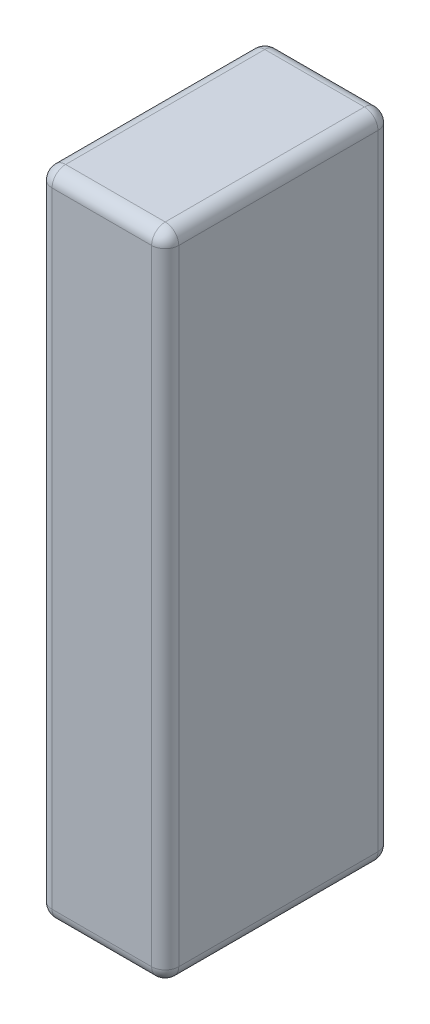
ISO-10303-21;
HEADER;
FILE_DESCRIPTION(('STEP AP214'),'2;1');
FILE_NAME('part.step','',(''),(''),'','','');
FILE_SCHEMA(('AUTOMOTIVE_DESIGN { 1 0 10303 214 1 1 1 1 }'));
ENDSEC;
DATA;
#1=APPLICATION_CONTEXT('core data for automotive mechanical design processes');
#2=APPLICATION_PROTOCOL_DEFINITION('international standard','automotive_design',2000,#1);
#3=PRODUCT_CONTEXT('',#1,'mechanical');
#4=PRODUCT('Part','Part','',(#3));
#5=PRODUCT_RELATED_PRODUCT_CATEGORY('part','',(#4));
#6=PRODUCT_DEFINITION_FORMATION('','',#4);
#7=PRODUCT_DEFINITION_CONTEXT('part definition',#1,'design');
#8=PRODUCT_DEFINITION('design','',#6,#7);
#9=PRODUCT_DEFINITION_SHAPE('','',#8);
#10=(LENGTH_UNIT() NAMED_UNIT(*) SI_UNIT(.MILLI.,.METRE.));
#11=(NAMED_UNIT(*) PLANE_ANGLE_UNIT() SI_UNIT($,.RADIAN.));
#12=(NAMED_UNIT(*) SI_UNIT($,.STERADIAN.) SOLID_ANGLE_UNIT());
#13=UNCERTAINTY_MEASURE_WITH_UNIT(LENGTH_MEASURE(1.E-05),#10,'distance_accuracy_value','');
#14=(GEOMETRIC_REPRESENTATION_CONTEXT(3) GLOBAL_UNCERTAINTY_ASSIGNED_CONTEXT((#13)) GLOBAL_UNIT_ASSIGNED_CONTEXT((#10,
#11,#12)) REPRESENTATION_CONTEXT('',''));
#15=CARTESIAN_POINT('',(0.,0.,0.));
#16=DIRECTION('',(0.,0.,1.));
#17=DIRECTION('',(1.,0.,0.));
#18=AXIS2_PLACEMENT_3D('',#15,#16,#17);
#19=CARTESIAN_POINT('',(0.,144.,0.));
#20=DIRECTION('',(1.,0.,0.));
#21=DIRECTION('',(0.,0.,-1.));
#22=AXIS2_PLACEMENT_3D('',#19,#20,#21);
#23=PLANE('',#22);
#24=DIRECTION('',(0.,0.,1.));
#25=VECTOR('',#24,1.);
#26=CARTESIAN_POINT('',(0.,141.,0.));
#27=LINE('',#26,#25);
#28=CARTESIAN_POINT('',(0.,141.,-3.));
#29=VERTEX_POINT('',#28);
#30=CARTESIAN_POINT('',(0.,141.,-47.));
#31=VERTEX_POINT('',#30);
#32=EDGE_CURVE('E152',#29,#31,#27,.F.);
#33=ORIENTED_EDGE('',*,*,#32,.T.);
#34=DIRECTION('',(0.,-1.,0.));
#35=VECTOR('',#34,1.);
#36=CARTESIAN_POINT('',(0.,144.,-47.));
#37=LINE('',#36,#35);
#38=CARTESIAN_POINT('',(0.,3.,-47.));
#39=VERTEX_POINT('',#38);
#40=EDGE_CURVE('E220',#31,#39,#37,.T.);
#41=ORIENTED_EDGE('',*,*,#40,.T.);
#42=DIRECTION('',(0.,0.,1.));
#43=VECTOR('',#42,1.);
#44=CARTESIAN_POINT('',(0.,3.,0.));
#45=LINE('',#44,#43);
#46=CARTESIAN_POINT('',(0.,3.,-3.));
#47=VERTEX_POINT('',#46);
#48=EDGE_CURVE('E279',#39,#47,#45,.T.);
#49=ORIENTED_EDGE('',*,*,#48,.T.);
#50=DIRECTION('',(0.,-1.,0.));
#51=VECTOR('',#50,1.);
#52=CARTESIAN_POINT('',(0.,144.,-3.));
#53=LINE('',#52,#51);
#54=EDGE_CURVE('E277',#47,#29,#53,.F.);
#55=ORIENTED_EDGE('',*,*,#54,.T.);
#56=EDGE_LOOP('',(#33,#41,#49,#55));
#57=FACE_BOUND('',#56,.T.);
#58=ADVANCED_FACE('F33',(#57),#23,.F.);
#59=CARTESIAN_POINT('',(0.,144.,0.));
#60=DIRECTION('',(0.,0.,-1.));
#61=DIRECTION('',(-1.,0.,0.));
#62=AXIS2_PLACEMENT_3D('',#59,#60,#61);
#63=PLANE('',#62);
#64=DIRECTION('',(1.,0.,0.));
#65=VECTOR('',#64,1.);
#66=CARTESIAN_POINT('',(0.,141.,0.));
#67=LINE('',#66,#65);
#68=CARTESIAN_POINT('',(25.,141.,0.));
#69=VERTEX_POINT('',#68);
#70=CARTESIAN_POINT('',(3.,141.,0.));
#71=VERTEX_POINT('',#70);
#72=EDGE_CURVE('E42',#69,#71,#67,.F.);
#73=ORIENTED_EDGE('',*,*,#72,.T.);
#74=DIRECTION('',(0.,-1.,0.));
#75=VECTOR('',#74,1.);
#76=CARTESIAN_POINT('',(3.,144.,0.));
#77=LINE('',#76,#75);
#78=CARTESIAN_POINT('',(3.,3.,0.));
#79=VERTEX_POINT('',#78);
#80=EDGE_CURVE('E11',#71,#79,#77,.T.);
#81=ORIENTED_EDGE('',*,*,#80,.T.);
#82=DIRECTION('',(1.,0.,0.));
#83=VECTOR('',#82,1.);
#84=CARTESIAN_POINT('',(28.,3.,0.));
#85=LINE('',#84,#83);
#86=CARTESIAN_POINT('',(25.,3.,0.));
#87=VERTEX_POINT('',#86);
#88=EDGE_CURVE('E226',#79,#87,#85,.T.);
#89=ORIENTED_EDGE('',*,*,#88,.T.);
#90=DIRECTION('',(0.,-1.,0.));
#91=VECTOR('',#90,1.);
#92=CARTESIAN_POINT('',(25.,144.,0.));
#93=LINE('',#92,#91);
#94=EDGE_CURVE('E53',#87,#69,#93,.F.);
#95=ORIENTED_EDGE('',*,*,#94,.T.);
#96=EDGE_LOOP('',(#73,#81,#89,#95));
#97=FACE_BOUND('',#96,.T.);
#98=ADVANCED_FACE('F317',(#97),#63,.F.);
#99=CARTESIAN_POINT('',(28.,144.,0.));
#100=DIRECTION('',(-1.,0.,0.));
#101=DIRECTION('',(0.,0.,1.));
#102=AXIS2_PLACEMENT_3D('',#99,#100,#101);
#103=PLANE('',#102);
#104=DIRECTION('',(0.,-1.,0.));
#105=VECTOR('',#104,1.);
#106=CARTESIAN_POINT('',(28.,144.,-47.));
#107=LINE('',#106,#105);
#108=CARTESIAN_POINT('',(28.,3.,-47.));
#109=VERTEX_POINT('',#108);
#110=CARTESIAN_POINT('',(28.,141.,-47.));
#111=VERTEX_POINT('',#110);
#112=EDGE_CURVE('E215',#109,#111,#107,.F.);
#113=ORIENTED_EDGE('',*,*,#112,.T.);
#114=DIRECTION('',(0.,0.,-1.));
#115=VECTOR('',#114,1.);
#116=CARTESIAN_POINT('',(28.,141.,0.));
#117=LINE('',#116,#115);
#118=CARTESIAN_POINT('',(28.,141.,-3.));
#119=VERTEX_POINT('',#118);
#120=EDGE_CURVE('E218',#111,#119,#117,.F.);
#121=ORIENTED_EDGE('',*,*,#120,.T.);
#122=DIRECTION('',(0.,-1.,0.));
#123=VECTOR('',#122,1.);
#124=CARTESIAN_POINT('',(28.,144.,-3.));
#125=LINE('',#124,#123);
#126=CARTESIAN_POINT('',(28.,3.,-3.));
#127=VERTEX_POINT('',#126);
#128=EDGE_CURVE('E216',#119,#127,#125,.T.);
#129=ORIENTED_EDGE('',*,*,#128,.T.);
#130=DIRECTION('',(0.,0.,-1.));
#131=VECTOR('',#130,1.);
#132=CARTESIAN_POINT('',(28.,3.,-50.));
#133=LINE('',#132,#131);
#134=EDGE_CURVE('E212',#127,#109,#133,.T.);
#135=ORIENTED_EDGE('',*,*,#134,.T.);
#136=EDGE_LOOP('',(#113,#121,#129,#135));
#137=FACE_BOUND('',#136,.T.);
#138=ADVANCED_FACE('F297',(#137),#103,.F.);
#139=CARTESIAN_POINT('',(0.,144.,-50.));
#140=DIRECTION('',(0.,0.,1.));
#141=DIRECTION('',(1.,0.,0.));
#142=AXIS2_PLACEMENT_3D('',#139,#140,#141);
#143=PLANE('',#142);
#144=DIRECTION('',(-1.,0.,0.));
#145=VECTOR('',#144,1.);
#146=CARTESIAN_POINT('',(0.,3.,-50.));
#147=LINE('',#146,#145);
#148=CARTESIAN_POINT('',(25.,3.,-50.));
#149=VERTEX_POINT('',#148);
#150=CARTESIAN_POINT('',(3.,3.,-50.));
#151=VERTEX_POINT('',#150);
#152=EDGE_CURVE('E256',#149,#151,#147,.T.);
#153=ORIENTED_EDGE('',*,*,#152,.T.);
#154=DIRECTION('',(0.,-1.,0.));
#155=VECTOR('',#154,1.);
#156=CARTESIAN_POINT('',(3.,144.,-50.));
#157=LINE('',#156,#155);
#158=CARTESIAN_POINT('',(3.,141.,-50.));
#159=VERTEX_POINT('',#158);
#160=EDGE_CURVE('E262',#151,#159,#157,.F.);
#161=ORIENTED_EDGE('',*,*,#160,.T.);
#162=DIRECTION('',(-1.,0.,0.));
#163=VECTOR('',#162,1.);
#164=CARTESIAN_POINT('',(0.,141.,-50.));
#165=LINE('',#164,#163);
#166=CARTESIAN_POINT('',(25.,141.,-50.));
#167=VERTEX_POINT('',#166);
#168=EDGE_CURVE('E259',#159,#167,#165,.F.);
#169=ORIENTED_EDGE('',*,*,#168,.T.);
#170=DIRECTION('',(0.,-1.,0.));
#171=VECTOR('',#170,1.);
#172=CARTESIAN_POINT('',(25.,144.,-50.));
#173=LINE('',#172,#171);
#174=EDGE_CURVE('E251',#167,#149,#173,.T.);
#175=ORIENTED_EDGE('',*,*,#174,.T.);
#176=EDGE_LOOP('',(#153,#161,#169,#175));
#177=FACE_BOUND('',#176,.T.);
#178=ADVANCED_FACE('F260',(#177),#143,.F.);
#179=CARTESIAN_POINT('',(0.,144.,0.));
#180=DIRECTION('',(0.,-1.,0.));
#181=DIRECTION('',(0.,0.,-1.));
#182=AXIS2_PLACEMENT_3D('',#179,#180,#181);
#183=PLANE('',#182);
#184=DIRECTION('',(0.,0.,-1.));
#185=VECTOR('',#184,1.);
#186=CARTESIAN_POINT('',(25.,144.,0.));
#187=LINE('',#186,#185);
#188=CARTESIAN_POINT('',(25.,144.,-3.));
#189=VERTEX_POINT('',#188);
#190=CARTESIAN_POINT('',(25.,144.,-47.));
#191=VERTEX_POINT('',#190);
#192=EDGE_CURVE('E131',#189,#191,#187,.T.);
#193=ORIENTED_EDGE('',*,*,#192,.T.);
#194=DIRECTION('',(-1.,0.,0.));
#195=VECTOR('',#194,1.);
#196=CARTESIAN_POINT('',(0.,144.,-47.));
#197=LINE('',#196,#195);
#198=CARTESIAN_POINT('',(3.,144.,-47.));
#199=VERTEX_POINT('',#198);
#200=EDGE_CURVE('E127',#191,#199,#197,.T.);
#201=ORIENTED_EDGE('',*,*,#200,.T.);
#202=DIRECTION('',(0.,0.,1.));
#203=VECTOR('',#202,1.);
#204=CARTESIAN_POINT('',(3.,144.,0.));
#205=LINE('',#204,#203);
#206=CARTESIAN_POINT('',(3.,144.,-3.));
#207=VERTEX_POINT('',#206);
#208=EDGE_CURVE('E121',#199,#207,#205,.T.);
#209=ORIENTED_EDGE('',*,*,#208,.T.);
#210=DIRECTION('',(1.,0.,0.));
#211=VECTOR('',#210,1.);
#212=CARTESIAN_POINT('',(0.,144.,-3.));
#213=LINE('',#212,#211);
#214=EDGE_CURVE('E124',#207,#189,#213,.T.);
#215=ORIENTED_EDGE('',*,*,#214,.T.);
#216=EDGE_LOOP('',(#193,#201,#209,#215));
#217=FACE_BOUND('',#216,.T.);
#218=ADVANCED_FACE('F123',(#217),#183,.F.);
#219=CARTESIAN_POINT('',(0.,0.,0.));
#220=DIRECTION('',(0.,-1.,0.));
#221=DIRECTION('',(0.,0.,-1.));
#222=AXIS2_PLACEMENT_3D('',#219,#220,#221);
#223=PLANE('',#222);
#224=DIRECTION('',(0.,0.,1.));
#225=VECTOR('',#224,1.);
#226=CARTESIAN_POINT('',(3.,0.,-50.));
#227=LINE('',#226,#225);
#228=CARTESIAN_POINT('',(3.,0.,-3.));
#229=VERTEX_POINT('',#228);
#230=CARTESIAN_POINT('',(3.,0.,-47.));
#231=VERTEX_POINT('',#230);
#232=EDGE_CURVE('E273',#229,#231,#227,.F.);
#233=ORIENTED_EDGE('',*,*,#232,.T.);
#234=DIRECTION('',(-1.,0.,0.));
#235=VECTOR('',#234,1.);
#236=CARTESIAN_POINT('',(28.,0.,-47.));
#237=LINE('',#236,#235);
#238=CARTESIAN_POINT('',(25.,0.,-47.));
#239=VERTEX_POINT('',#238);
#240=EDGE_CURVE('E275',#231,#239,#237,.F.);
#241=ORIENTED_EDGE('',*,*,#240,.T.);
#242=DIRECTION('',(0.,0.,-1.));
#243=VECTOR('',#242,1.);
#244=CARTESIAN_POINT('',(25.,0.,0.));
#245=LINE('',#244,#243);
#246=CARTESIAN_POINT('',(25.,0.,-3.));
#247=VERTEX_POINT('',#246);
#248=EDGE_CURVE('E210',#239,#247,#245,.F.);
#249=ORIENTED_EDGE('',*,*,#248,.T.);
#250=DIRECTION('',(1.,0.,0.));
#251=VECTOR('',#250,1.);
#252=CARTESIAN_POINT('',(0.,0.,-3.));
#253=LINE('',#252,#251);
#254=EDGE_CURVE('E267',#247,#229,#253,.F.);
#255=ORIENTED_EDGE('',*,*,#254,.T.);
#256=EDGE_LOOP('',(#233,#241,#249,#255));
#257=FACE_BOUND('',#256,.T.);
#258=ADVANCED_FACE('F356',(#257),#223,.T.);
#259=CARTESIAN_POINT('',(0.,3.,-3.));
#260=DIRECTION('',(-1.,0.,0.));
#261=DIRECTION('',(0.,0.,1.));
#262=AXIS2_PLACEMENT_3D('',#259,#260,#261);
#263=CYLINDRICAL_SURFACE('',#262,3.);
#264=CARTESIAN_POINT('',(25.,3.,-3.));
#265=DIRECTION('',(1.,0.,0.));
#266=DIRECTION('',(0.,0.,-1.));
#267=AXIS2_PLACEMENT_3D('',#264,#265,#266);
#268=CIRCLE('',#267,3.);
#269=EDGE_CURVE('E37',#87,#247,#268,.T.);
#270=ORIENTED_EDGE('',*,*,#269,.F.);
#271=ORIENTED_EDGE('',*,*,#88,.F.);
#272=CARTESIAN_POINT('',(3.,3.,-3.));
#273=DIRECTION('',(-1.,0.,0.));
#274=DIRECTION('',(0.,0.,1.));
#275=AXIS2_PLACEMENT_3D('',#272,#273,#274);
#276=CIRCLE('',#275,3.);
#277=EDGE_CURVE('E190',#229,#79,#276,.T.);
#278=ORIENTED_EDGE('',*,*,#277,.F.);
#279=ORIENTED_EDGE('',*,*,#254,.F.);
#280=EDGE_LOOP('',(#270,#271,#278,#279));
#281=FACE_BOUND('',#280,.T.);
#282=ADVANCED_FACE('F35',(#281),#263,.T.);
#283=CARTESIAN_POINT('',(25.,3.,-3.));
#284=DIRECTION('',(0.,0.,1.));
#285=DIRECTION('',(1.,0.,0.));
#286=AXIS2_PLACEMENT_3D('',#283,#284,#285);
#287=SPHERICAL_SURFACE('',#286,3.);
#288=CARTESIAN_POINT('',(25.,3.,-3.));
#289=DIRECTION('',(0.,-1.,0.));
#290=DIRECTION('',(0.,0.,-1.));
#291=AXIS2_PLACEMENT_3D('',#288,#289,#290);
#292=CIRCLE('',#291,3.);
#293=EDGE_CURVE('E185',#87,#127,#292,.F.);
#294=ORIENTED_EDGE('',*,*,#293,.F.);
#295=ORIENTED_EDGE('',*,*,#269,.T.);
#296=CARTESIAN_POINT('',(25.,3.,-3.));
#297=DIRECTION('',(0.,0.,1.));
#298=DIRECTION('',(1.,0.,0.));
#299=AXIS2_PLACEMENT_3D('',#296,#297,#298);
#300=CIRCLE('',#299,3.);
#301=EDGE_CURVE('E188',#127,#247,#300,.F.);
#302=ORIENTED_EDGE('',*,*,#301,.F.);
#303=EDGE_LOOP('',(#294,#295,#302));
#304=FACE_BOUND('',#303,.T.);
#305=ADVANCED_FACE('F202',(#304),#287,.T.);
#306=CARTESIAN_POINT('',(3.,3.,-3.));
#307=DIRECTION('',(0.,0.,1.));
#308=DIRECTION('',(1.,0.,0.));
#309=AXIS2_PLACEMENT_3D('',#306,#307,#308);
#310=SPHERICAL_SURFACE('',#309,3.);
#311=CARTESIAN_POINT('',(3.,3.,-3.));
#312=DIRECTION('',(0.,0.,1.));
#313=DIRECTION('',(1.,0.,0.));
#314=AXIS2_PLACEMENT_3D('',#311,#312,#313);
#315=CIRCLE('',#314,3.);
#316=EDGE_CURVE('E180',#229,#47,#315,.F.);
#317=ORIENTED_EDGE('',*,*,#316,.F.);
#318=ORIENTED_EDGE('',*,*,#277,.T.);
#319=CARTESIAN_POINT('',(3.,3.,-3.));
#320=DIRECTION('',(0.,-1.,0.));
#321=DIRECTION('',(0.,0.,-1.));
#322=AXIS2_PLACEMENT_3D('',#319,#320,#321);
#323=CIRCLE('',#322,3.);
#324=EDGE_CURVE('E183',#47,#79,#323,.F.);
#325=ORIENTED_EDGE('',*,*,#324,.F.);
#326=EDGE_LOOP('',(#317,#318,#325));
#327=FACE_BOUND('',#326,.T.);
#328=ADVANCED_FACE('F353',(#327),#310,.T.);
#329=CARTESIAN_POINT('',(25.,3.,0.));
#330=DIRECTION('',(0.,0.,1.));
#331=DIRECTION('',(1.,0.,0.));
#332=AXIS2_PLACEMENT_3D('',#329,#330,#331);
#333=CYLINDRICAL_SURFACE('',#332,3.);
#334=ORIENTED_EDGE('',*,*,#301,.T.);
#335=ORIENTED_EDGE('',*,*,#248,.F.);
#336=CARTESIAN_POINT('',(25.,3.,-47.));
#337=DIRECTION('',(0.,0.,-1.));
#338=DIRECTION('',(-1.,0.,0.));
#339=AXIS2_PLACEMENT_3D('',#336,#337,#338);
#340=CIRCLE('',#339,3.);
#341=EDGE_CURVE('E175',#109,#239,#340,.T.);
#342=ORIENTED_EDGE('',*,*,#341,.F.);
#343=ORIENTED_EDGE('',*,*,#134,.F.);
#344=EDGE_LOOP('',(#334,#335,#342,#343));
#345=FACE_BOUND('',#344,.T.);
#346=ADVANCED_FACE('F208',(#345),#333,.T.);
#347=CARTESIAN_POINT('',(25.,144.,-3.));
#348=DIRECTION('',(0.,-1.,0.));
#349=DIRECTION('',(0.,0.,-1.));
#350=AXIS2_PLACEMENT_3D('',#347,#348,#349);
#351=CYLINDRICAL_SURFACE('',#350,3.);
#352=ORIENTED_EDGE('',*,*,#293,.T.);
#353=ORIENTED_EDGE('',*,*,#128,.F.);
#354=CARTESIAN_POINT('',(25.,141.,-3.));
#355=DIRECTION('',(0.,1.,0.));
#356=DIRECTION('',(0.,0.,1.));
#357=AXIS2_PLACEMENT_3D('',#354,#355,#356);
#358=CIRCLE('',#357,3.);
#359=EDGE_CURVE('E172',#69,#119,#358,.T.);
#360=ORIENTED_EDGE('',*,*,#359,.F.);
#361=ORIENTED_EDGE('',*,*,#94,.F.);
#362=EDGE_LOOP('',(#352,#353,#360,#361));
#363=FACE_BOUND('',#362,.T.);
#364=ADVANCED_FACE('F301',(#363),#351,.T.);
#365=CARTESIAN_POINT('',(0.,141.,-3.));
#366=DIRECTION('',(1.,0.,0.));
#367=DIRECTION('',(0.,0.,-1.));
#368=AXIS2_PLACEMENT_3D('',#365,#366,#367);
#369=CYLINDRICAL_SURFACE('',#368,3.);
#370=CARTESIAN_POINT('',(3.,141.,-3.));
#371=DIRECTION('',(-1.,0.,0.));
#372=DIRECTION('',(0.,0.,1.));
#373=AXIS2_PLACEMENT_3D('',#370,#371,#372);
#374=CIRCLE('',#373,3.);
#375=EDGE_CURVE('E137',#71,#207,#374,.T.);
#376=ORIENTED_EDGE('',*,*,#375,.F.);
#377=ORIENTED_EDGE('',*,*,#72,.F.);
#378=CARTESIAN_POINT('',(25.,141.,-3.));
#379=DIRECTION('',(1.,0.,0.));
#380=DIRECTION('',(0.,0.,-1.));
#381=AXIS2_PLACEMENT_3D('',#378,#379,#380);
#382=CIRCLE('',#381,3.);
#383=EDGE_CURVE('E140',#189,#69,#382,.T.);
#384=ORIENTED_EDGE('',*,*,#383,.F.);
#385=ORIENTED_EDGE('',*,*,#214,.F.);
#386=EDGE_LOOP('',(#376,#377,#384,#385));
#387=FACE_BOUND('',#386,.T.);
#388=ADVANCED_FACE('F136',(#387),#369,.T.);
#389=CARTESIAN_POINT('',(3.,144.,-3.));
#390=DIRECTION('',(0.,-1.,0.));
#391=DIRECTION('',(0.,0.,-1.));
#392=AXIS2_PLACEMENT_3D('',#389,#390,#391);
#393=CYLINDRICAL_SURFACE('',#392,3.);
#394=ORIENTED_EDGE('',*,*,#324,.T.);
#395=ORIENTED_EDGE('',*,*,#80,.F.);
#396=CARTESIAN_POINT('',(3.,141.,-3.));
#397=DIRECTION('',(0.,1.,0.));
#398=DIRECTION('',(0.,0.,1.));
#399=AXIS2_PLACEMENT_3D('',#396,#397,#398);
#400=CIRCLE('',#399,3.);
#401=EDGE_CURVE('E149',#29,#71,#400,.T.);
#402=ORIENTED_EDGE('',*,*,#401,.F.);
#403=ORIENTED_EDGE('',*,*,#54,.F.);
#404=EDGE_LOOP('',(#394,#395,#402,#403));
#405=FACE_BOUND('',#404,.T.);
#406=ADVANCED_FACE('F355',(#405),#393,.T.);
#407=CARTESIAN_POINT('',(3.,3.,0.));
#408=DIRECTION('',(0.,0.,-1.));
#409=DIRECTION('',(-1.,0.,0.));
#410=AXIS2_PLACEMENT_3D('',#407,#408,#409);
#411=CYLINDRICAL_SURFACE('',#410,3.);
#412=ORIENTED_EDGE('',*,*,#316,.T.);
#413=ORIENTED_EDGE('',*,*,#48,.F.);
#414=CARTESIAN_POINT('',(3.,3.,-47.));
#415=DIRECTION('',(0.,0.,-1.));
#416=DIRECTION('',(-1.,0.,0.));
#417=AXIS2_PLACEMENT_3D('',#414,#415,#416);
#418=CIRCLE('',#417,3.);
#419=EDGE_CURVE('E167',#231,#39,#418,.T.);
#420=ORIENTED_EDGE('',*,*,#419,.F.);
#421=ORIENTED_EDGE('',*,*,#232,.F.);
#422=EDGE_LOOP('',(#412,#413,#420,#421));
#423=FACE_BOUND('',#422,.T.);
#424=ADVANCED_FACE('F351',(#423),#411,.T.);
#425=CARTESIAN_POINT('',(0.,3.,-47.));
#426=DIRECTION('',(1.,0.,0.));
#427=DIRECTION('',(0.,0.,-1.));
#428=AXIS2_PLACEMENT_3D('',#425,#426,#427);
#429=CYLINDRICAL_SURFACE('',#428,3.);
#430=CARTESIAN_POINT('',(25.,3.,-47.));
#431=DIRECTION('',(1.,0.,0.));
#432=DIRECTION('',(0.,0.,-1.));
#433=AXIS2_PLACEMENT_3D('',#430,#431,#432);
#434=CIRCLE('',#433,3.);
#435=EDGE_CURVE('E177',#239,#149,#434,.T.);
#436=ORIENTED_EDGE('',*,*,#435,.F.);
#437=ORIENTED_EDGE('',*,*,#240,.F.);
#438=CARTESIAN_POINT('',(3.,3.,-47.));
#439=DIRECTION('',(-1.,0.,0.));
#440=DIRECTION('',(0.,0.,1.));
#441=AXIS2_PLACEMENT_3D('',#438,#439,#440);
#442=CIRCLE('',#441,3.);
#443=EDGE_CURVE('E164',#151,#231,#442,.T.);
#444=ORIENTED_EDGE('',*,*,#443,.F.);
#445=ORIENTED_EDGE('',*,*,#152,.F.);
#446=EDGE_LOOP('',(#436,#437,#444,#445));
#447=FACE_BOUND('',#446,.T.);
#448=ADVANCED_FACE('F313',(#447),#429,.T.);
#449=CARTESIAN_POINT('',(25.,3.,-47.));
#450=DIRECTION('',(0.,0.,1.));
#451=DIRECTION('',(1.,0.,0.));
#452=AXIS2_PLACEMENT_3D('',#449,#450,#451);
#453=SPHERICAL_SURFACE('',#452,3.);
#454=ORIENTED_EDGE('',*,*,#341,.T.);
#455=ORIENTED_EDGE('',*,*,#435,.T.);
#456=CARTESIAN_POINT('',(25.,3.,-47.));
#457=DIRECTION('',(0.,-1.,0.));
#458=DIRECTION('',(0.,0.,-1.));
#459=AXIS2_PLACEMENT_3D('',#456,#457,#458);
#460=CIRCLE('',#459,3.);
#461=EDGE_CURVE('E156',#109,#149,#460,.F.);
#462=ORIENTED_EDGE('',*,*,#461,.F.);
#463=EDGE_LOOP('',(#454,#455,#462));
#464=FACE_BOUND('',#463,.T.);
#465=ADVANCED_FACE('F305',(#464),#453,.T.);
#466=CARTESIAN_POINT('',(25.,141.,-3.));
#467=DIRECTION('',(0.,0.,1.));
#468=DIRECTION('',(1.,0.,0.));
#469=AXIS2_PLACEMENT_3D('',#466,#467,#468);
#470=SPHERICAL_SURFACE('',#469,3.);
#471=ORIENTED_EDGE('',*,*,#383,.T.);
#472=ORIENTED_EDGE('',*,*,#359,.T.);
#473=CARTESIAN_POINT('',(25.,141.,-3.));
#474=DIRECTION('',(0.,0.,1.));
#475=DIRECTION('',(1.,0.,0.));
#476=AXIS2_PLACEMENT_3D('',#473,#474,#475);
#477=CIRCLE('',#476,3.);
#478=EDGE_CURVE('E153',#189,#119,#477,.F.);
#479=ORIENTED_EDGE('',*,*,#478,.F.);
#480=EDGE_LOOP('',(#471,#472,#479));
#481=FACE_BOUND('',#480,.T.);
#482=ADVANCED_FACE('F303',(#481),#470,.T.);
#483=CARTESIAN_POINT('',(3.,141.,-3.));
#484=DIRECTION('',(0.,0.,1.));
#485=DIRECTION('',(1.,0.,0.));
#486=AXIS2_PLACEMENT_3D('',#483,#484,#485);
#487=SPHERICAL_SURFACE('',#486,3.);
#488=ORIENTED_EDGE('',*,*,#401,.T.);
#489=ORIENTED_EDGE('',*,*,#375,.T.);
#490=CARTESIAN_POINT('',(3.,141.,-3.));
#491=DIRECTION('',(0.,0.,1.));
#492=DIRECTION('',(1.,0.,0.));
#493=AXIS2_PLACEMENT_3D('',#490,#491,#492);
#494=CIRCLE('',#493,3.);
#495=EDGE_CURVE('E146',#29,#207,#494,.F.);
#496=ORIENTED_EDGE('',*,*,#495,.F.);
#497=EDGE_LOOP('',(#488,#489,#496));
#498=FACE_BOUND('',#497,.T.);
#499=ADVANCED_FACE('F145',(#498),#487,.T.);
#500=CARTESIAN_POINT('',(3.,3.,-47.));
#501=DIRECTION('',(0.,0.,1.));
#502=DIRECTION('',(1.,0.,0.));
#503=AXIS2_PLACEMENT_3D('',#500,#501,#502);
#504=SPHERICAL_SURFACE('',#503,3.);
#505=ORIENTED_EDGE('',*,*,#443,.T.);
#506=ORIENTED_EDGE('',*,*,#419,.T.);
#507=CARTESIAN_POINT('',(3.,3.,-47.));
#508=DIRECTION('',(0.,-1.,0.));
#509=DIRECTION('',(0.,0.,-1.));
#510=AXIS2_PLACEMENT_3D('',#507,#508,#509);
#511=CIRCLE('',#510,3.);
#512=EDGE_CURVE('E154',#151,#39,#511,.F.);
#513=ORIENTED_EDGE('',*,*,#512,.F.);
#514=EDGE_LOOP('',(#505,#506,#513));
#515=FACE_BOUND('',#514,.T.);
#516=ADVANCED_FACE('F311',(#515),#504,.T.);
#517=CARTESIAN_POINT('',(25.,144.,-47.));
#518=DIRECTION('',(0.,-1.,0.));
#519=DIRECTION('',(0.,0.,-1.));
#520=AXIS2_PLACEMENT_3D('',#517,#518,#519);
#521=CYLINDRICAL_SURFACE('',#520,3.);
#522=ORIENTED_EDGE('',*,*,#461,.T.);
#523=ORIENTED_EDGE('',*,*,#174,.F.);
#524=CARTESIAN_POINT('',(25.,141.,-47.));
#525=DIRECTION('',(0.,1.,0.));
#526=DIRECTION('',(0.,0.,1.));
#527=AXIS2_PLACEMENT_3D('',#524,#525,#526);
#528=CIRCLE('',#527,3.);
#529=EDGE_CURVE('E158',#111,#167,#528,.T.);
#530=ORIENTED_EDGE('',*,*,#529,.F.);
#531=ORIENTED_EDGE('',*,*,#112,.F.);
#532=EDGE_LOOP('',(#522,#523,#530,#531));
#533=FACE_BOUND('',#532,.T.);
#534=ADVANCED_FACE('F253',(#533),#521,.T.);
#535=CARTESIAN_POINT('',(25.,141.,0.));
#536=DIRECTION('',(0.,0.,-1.));
#537=DIRECTION('',(-1.,0.,0.));
#538=AXIS2_PLACEMENT_3D('',#535,#536,#537);
#539=CYLINDRICAL_SURFACE('',#538,3.);
#540=ORIENTED_EDGE('',*,*,#478,.T.);
#541=ORIENTED_EDGE('',*,*,#120,.F.);
#542=CARTESIAN_POINT('',(25.,141.,-47.));
#543=DIRECTION('',(0.,0.,-1.));
#544=DIRECTION('',(-1.,0.,0.));
#545=AXIS2_PLACEMENT_3D('',#542,#543,#544);
#546=CIRCLE('',#545,3.);
#547=EDGE_CURVE('E240',#191,#111,#546,.T.);
#548=ORIENTED_EDGE('',*,*,#547,.F.);
#549=ORIENTED_EDGE('',*,*,#192,.F.);
#550=EDGE_LOOP('',(#540,#541,#548,#549));
#551=FACE_BOUND('',#550,.T.);
#552=ADVANCED_FACE('F296',(#551),#539,.T.);
#553=CARTESIAN_POINT('',(3.,141.,0.));
#554=DIRECTION('',(0.,0.,1.));
#555=DIRECTION('',(1.,0.,0.));
#556=AXIS2_PLACEMENT_3D('',#553,#554,#555);
#557=CYLINDRICAL_SURFACE('',#556,3.);
#558=ORIENTED_EDGE('',*,*,#495,.T.);
#559=ORIENTED_EDGE('',*,*,#208,.F.);
#560=CARTESIAN_POINT('',(3.,141.,-47.));
#561=DIRECTION('',(0.,0.,-1.));
#562=DIRECTION('',(-1.,0.,0.));
#563=AXIS2_PLACEMENT_3D('',#560,#561,#562);
#564=CIRCLE('',#563,3.);
#565=EDGE_CURVE('E237',#31,#199,#564,.T.);
#566=ORIENTED_EDGE('',*,*,#565,.F.);
#567=ORIENTED_EDGE('',*,*,#32,.F.);
#568=EDGE_LOOP('',(#558,#559,#566,#567));
#569=FACE_BOUND('',#568,.T.);
#570=ADVANCED_FACE('F151',(#569),#557,.T.);
#571=CARTESIAN_POINT('',(3.,144.,-47.));
#572=DIRECTION('',(0.,-1.,0.));
#573=DIRECTION('',(0.,0.,-1.));
#574=AXIS2_PLACEMENT_3D('',#571,#572,#573);
#575=CYLINDRICAL_SURFACE('',#574,3.);
#576=ORIENTED_EDGE('',*,*,#512,.T.);
#577=ORIENTED_EDGE('',*,*,#40,.F.);
#578=CARTESIAN_POINT('',(3.,141.,-47.));
#579=DIRECTION('',(0.,1.,0.));
#580=DIRECTION('',(0.,0.,1.));
#581=AXIS2_PLACEMENT_3D('',#578,#579,#580);
#582=CIRCLE('',#581,3.);
#583=EDGE_CURVE('E234',#159,#31,#582,.T.);
#584=ORIENTED_EDGE('',*,*,#583,.F.);
#585=ORIENTED_EDGE('',*,*,#160,.F.);
#586=EDGE_LOOP('',(#576,#577,#584,#585));
#587=FACE_BOUND('',#586,.T.);
#588=ADVANCED_FACE('F286',(#587),#575,.T.);
#589=CARTESIAN_POINT('',(25.,141.,-47.));
#590=DIRECTION('',(0.,0.,1.));
#591=DIRECTION('',(1.,0.,0.));
#592=AXIS2_PLACEMENT_3D('',#589,#590,#591);
#593=SPHERICAL_SURFACE('',#592,3.);
#594=ORIENTED_EDGE('',*,*,#547,.T.);
#595=ORIENTED_EDGE('',*,*,#529,.T.);
#596=CARTESIAN_POINT('',(25.,141.,-47.));
#597=DIRECTION('',(1.,0.,0.));
#598=DIRECTION('',(0.,0.,-1.));
#599=AXIS2_PLACEMENT_3D('',#596,#597,#598);
#600=CIRCLE('',#599,3.);
#601=EDGE_CURVE('E232',#191,#167,#600,.F.);
#602=ORIENTED_EDGE('',*,*,#601,.F.);
#603=EDGE_LOOP('',(#594,#595,#602));
#604=FACE_BOUND('',#603,.T.);
#605=ADVANCED_FACE('F247',(#604),#593,.T.);
#606=CARTESIAN_POINT('',(3.,141.,-47.));
#607=DIRECTION('',(0.,0.,1.));
#608=DIRECTION('',(1.,0.,0.));
#609=AXIS2_PLACEMENT_3D('',#606,#607,#608);
#610=SPHERICAL_SURFACE('',#609,3.);
#611=ORIENTED_EDGE('',*,*,#583,.T.);
#612=ORIENTED_EDGE('',*,*,#565,.T.);
#613=CARTESIAN_POINT('',(3.,141.,-47.));
#614=DIRECTION('',(-1.,0.,0.));
#615=DIRECTION('',(0.,0.,1.));
#616=AXIS2_PLACEMENT_3D('',#613,#614,#615);
#617=CIRCLE('',#616,3.);
#618=EDGE_CURVE('E230',#159,#199,#617,.F.);
#619=ORIENTED_EDGE('',*,*,#618,.F.);
#620=EDGE_LOOP('',(#611,#612,#619));
#621=FACE_BOUND('',#620,.T.);
#622=ADVANCED_FACE('F289',(#621),#610,.T.);
#623=CARTESIAN_POINT('',(0.,141.,-47.));
#624=DIRECTION('',(-1.,0.,0.));
#625=DIRECTION('',(0.,0.,1.));
#626=AXIS2_PLACEMENT_3D('',#623,#624,#625);
#627=CYLINDRICAL_SURFACE('',#626,3.);
#628=ORIENTED_EDGE('',*,*,#601,.T.);
#629=ORIENTED_EDGE('',*,*,#168,.F.);
#630=ORIENTED_EDGE('',*,*,#618,.T.);
#631=ORIENTED_EDGE('',*,*,#200,.F.);
#632=EDGE_LOOP('',(#628,#629,#630,#631));
#633=FACE_BOUND('',#632,.T.);
#634=ADVANCED_FACE('F290',(#633),#627,.T.);
#635=CLOSED_SHELL('',(#58,#98,#138,#178,#218,#258,#282,#305,#328,#346,#364,#388,#406,#424,#448,
#465,#482,#499,#516,#534,#552,#570,#588,#605,#622,#634));
#636=MANIFOLD_SOLID_BREP('B2',#635);
#637=ADVANCED_BREP_SHAPE_REPRESENTATION('',(#18,#636),#14);
#638=SHAPE_DEFINITION_REPRESENTATION(#9,#637);
ENDSEC;
END-ISO-10303-21;
